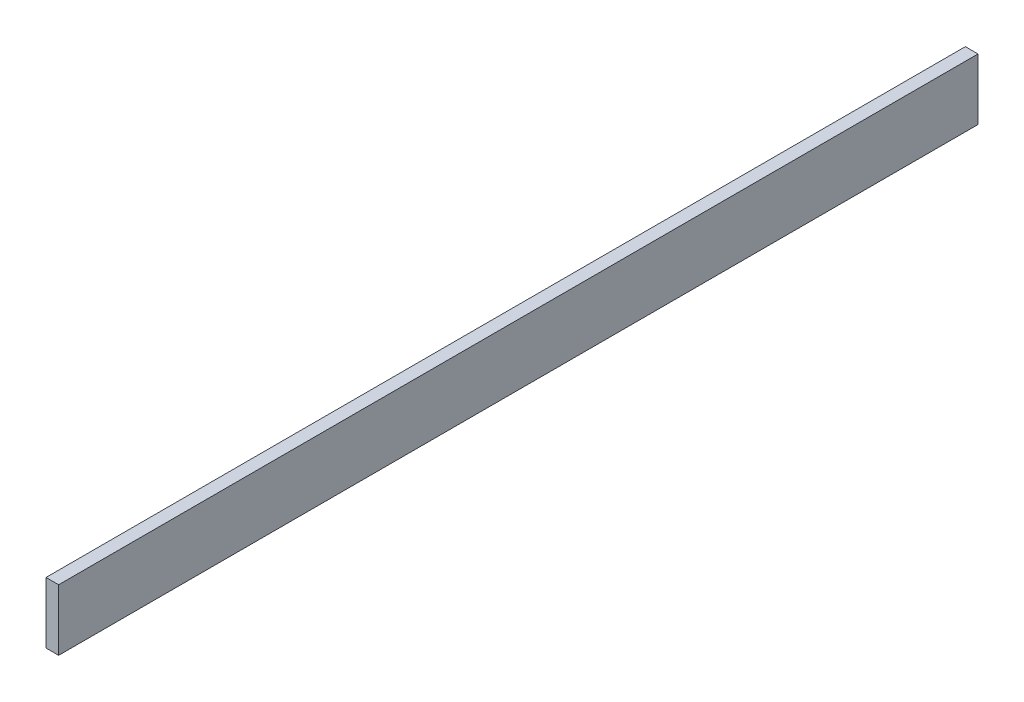
ISO-10303-21;
HEADER;
FILE_DESCRIPTION(('STEP AP214'),'2;1');
FILE_NAME('part.step','',(''),(''),'','','');
FILE_SCHEMA(('AUTOMOTIVE_DESIGN { 1 0 10303 214 1 1 1 1 }'));
ENDSEC;
DATA;
#1=APPLICATION_CONTEXT('core data for automotive mechanical design processes');
#2=APPLICATION_PROTOCOL_DEFINITION('international standard','automotive_design',2000,#1);
#3=PRODUCT_CONTEXT('',#1,'mechanical');
#4=PRODUCT('Part','Part','',(#3));
#5=PRODUCT_RELATED_PRODUCT_CATEGORY('part','',(#4));
#6=PRODUCT_DEFINITION_FORMATION('','',#4);
#7=PRODUCT_DEFINITION_CONTEXT('part definition',#1,'design');
#8=PRODUCT_DEFINITION('design','',#6,#7);
#9=PRODUCT_DEFINITION_SHAPE('','',#8);
#10=(LENGTH_UNIT() NAMED_UNIT(*) SI_UNIT(.MILLI.,.METRE.));
#11=(NAMED_UNIT(*) PLANE_ANGLE_UNIT() SI_UNIT($,.RADIAN.));
#12=(NAMED_UNIT(*) SI_UNIT($,.STERADIAN.) SOLID_ANGLE_UNIT());
#13=UNCERTAINTY_MEASURE_WITH_UNIT(LENGTH_MEASURE(1.E-05),#10,'distance_accuracy_value','');
#14=(GEOMETRIC_REPRESENTATION_CONTEXT(3) GLOBAL_UNCERTAINTY_ASSIGNED_CONTEXT((#13)) GLOBAL_UNIT_ASSIGNED_CONTEXT((#10,
#11,#12)) REPRESENTATION_CONTEXT('',''));
#15=CARTESIAN_POINT('',(0.,0.,0.));
#16=DIRECTION('',(0.,0.,1.));
#17=DIRECTION('',(1.,0.,0.));
#18=AXIS2_PLACEMENT_3D('',#15,#16,#17);
#19=CARTESIAN_POINT('',(38.1,50.8,474.171818181819));
#20=DIRECTION('',(0.,0.,-1.));
#21=DIRECTION('',(-1.,0.,0.));
#22=AXIS2_PLACEMENT_3D('',#19,#20,#21);
#23=PLANE('',#22);
#24=DIRECTION('',(0.,-1.,0.));
#25=VECTOR('',#24,1.);
#26=CARTESIAN_POINT('',(0.,50.8,474.171818181819));
#27=LINE('',#26,#25);
#28=CARTESIAN_POINT('',(0.,234.95,474.171818181819));
#29=VERTEX_POINT('',#28);
#30=CARTESIAN_POINT('',(0.,50.8,474.171818181819));
#31=VERTEX_POINT('',#30);
#32=EDGE_CURVE('E96',#29,#31,#27,.T.);
#33=ORIENTED_EDGE('',*,*,#32,.T.);
#34=DIRECTION('',(-1.,0.,0.));
#35=VECTOR('',#34,1.);
#36=CARTESIAN_POINT('',(38.1,50.8,474.171818181819));
#37=LINE('',#36,#35);
#38=CARTESIAN_POINT('',(38.1,50.8,474.171818181819));
#39=VERTEX_POINT('',#38);
#40=EDGE_CURVE('E11',#39,#31,#37,.T.);
#41=ORIENTED_EDGE('',*,*,#40,.F.);
#42=DIRECTION('',(0.,-1.,0.));
#43=VECTOR('',#42,1.);
#44=CARTESIAN_POINT('',(38.1,50.8,474.171818181819));
#45=LINE('',#44,#43);
#46=CARTESIAN_POINT('',(38.1,234.95,474.171818181819));
#47=VERTEX_POINT('',#46);
#48=EDGE_CURVE('E84',#47,#39,#45,.T.);
#49=ORIENTED_EDGE('',*,*,#48,.F.);
#50=DIRECTION('',(-1.,0.,0.));
#51=VECTOR('',#50,1.);
#52=CARTESIAN_POINT('',(38.1,234.95,474.171818181819));
#53=LINE('',#52,#51);
#54=EDGE_CURVE('E92',#47,#29,#53,.T.);
#55=ORIENTED_EDGE('',*,*,#54,.T.);
#56=EDGE_LOOP('',(#33,#41,#49,#55));
#57=FACE_BOUND('',#56,.T.);
#58=ADVANCED_FACE('F33',(#57),#23,.F.);
#59=CARTESIAN_POINT('',(38.1,50.8,474.171818181819));
#60=DIRECTION('',(0.,1.,0.));
#61=DIRECTION('',(0.,0.,1.));
#62=AXIS2_PLACEMENT_3D('',#59,#60,#61);
#63=PLANE('',#62);
#64=DIRECTION('',(0.,0.,-1.));
#65=VECTOR('',#64,1.);
#66=CARTESIAN_POINT('',(0.,50.8,474.171818181819));
#67=LINE('',#66,#65);
#68=CARTESIAN_POINT('',(0.,50.8,-2294.42818181818));
#69=VERTEX_POINT('',#68);
#70=EDGE_CURVE('E88',#31,#69,#67,.T.);
#71=ORIENTED_EDGE('',*,*,#70,.T.);
#72=DIRECTION('',(-1.,0.,0.));
#73=VECTOR('',#72,1.);
#74=CARTESIAN_POINT('',(38.1,50.8,-2294.42818181818));
#75=LINE('',#74,#73);
#76=CARTESIAN_POINT('',(38.1,50.8,-2294.42818181818));
#77=VERTEX_POINT('',#76);
#78=EDGE_CURVE('E41',#77,#69,#75,.T.);
#79=ORIENTED_EDGE('',*,*,#78,.F.);
#80=DIRECTION('',(0.,0.,-1.));
#81=VECTOR('',#80,1.);
#82=CARTESIAN_POINT('',(38.1,50.8,474.171818181819));
#83=LINE('',#82,#81);
#84=EDGE_CURVE('E79',#39,#77,#83,.T.);
#85=ORIENTED_EDGE('',*,*,#84,.F.);
#86=ORIENTED_EDGE('',*,*,#40,.T.);
#87=EDGE_LOOP('',(#71,#79,#85,#86));
#88=FACE_BOUND('',#87,.T.);
#89=ADVANCED_FACE('F87',(#88),#63,.F.);
#90=CARTESIAN_POINT('',(38.1,50.8,-2294.42818181818));
#91=DIRECTION('',(0.,0.,1.));
#92=DIRECTION('',(1.,0.,0.));
#93=AXIS2_PLACEMENT_3D('',#90,#91,#92);
#94=PLANE('',#93);
#95=DIRECTION('',(0.,1.,0.));
#96=VECTOR('',#95,1.);
#97=CARTESIAN_POINT('',(0.,50.8,-2294.42818181818));
#98=LINE('',#97,#96);
#99=CARTESIAN_POINT('',(0.,234.95,-2294.42818181818));
#100=VERTEX_POINT('',#99);
#101=EDGE_CURVE('E66',#69,#100,#98,.T.);
#102=ORIENTED_EDGE('',*,*,#101,.T.);
#103=DIRECTION('',(-1.,0.,0.));
#104=VECTOR('',#103,1.);
#105=CARTESIAN_POINT('',(38.1,234.95,-2294.42818181818));
#106=LINE('',#105,#104);
#107=CARTESIAN_POINT('',(38.1,234.95,-2294.42818181818));
#108=VERTEX_POINT('',#107);
#109=EDGE_CURVE('E89',#108,#100,#106,.T.);
#110=ORIENTED_EDGE('',*,*,#109,.F.);
#111=DIRECTION('',(0.,1.,0.));
#112=VECTOR('',#111,1.);
#113=CARTESIAN_POINT('',(38.1,50.8,-2294.42818181818));
#114=LINE('',#113,#112);
#115=EDGE_CURVE('E82',#77,#108,#114,.T.);
#116=ORIENTED_EDGE('',*,*,#115,.F.);
#117=ORIENTED_EDGE('',*,*,#78,.T.);
#118=EDGE_LOOP('',(#102,#110,#116,#117));
#119=FACE_BOUND('',#118,.T.);
#120=ADVANCED_FACE('F90',(#119),#94,.F.);
#121=CARTESIAN_POINT('',(38.1,234.95,474.171818181819));
#122=DIRECTION('',(0.,-1.,0.));
#123=DIRECTION('',(0.,0.,-1.));
#124=AXIS2_PLACEMENT_3D('',#121,#122,#123);
#125=PLANE('',#124);
#126=DIRECTION('',(0.,0.,1.));
#127=VECTOR('',#126,1.);
#128=CARTESIAN_POINT('',(0.,234.95,474.171818181819));
#129=LINE('',#128,#127);
#130=EDGE_CURVE('E72',#100,#29,#129,.T.);
#131=ORIENTED_EDGE('',*,*,#130,.T.);
#132=ORIENTED_EDGE('',*,*,#54,.F.);
#133=DIRECTION('',(0.,0.,1.));
#134=VECTOR('',#133,1.);
#135=CARTESIAN_POINT('',(38.1,234.95,474.171818181819));
#136=LINE('',#135,#134);
#137=EDGE_CURVE('E49',#108,#47,#136,.T.);
#138=ORIENTED_EDGE('',*,*,#137,.F.);
#139=ORIENTED_EDGE('',*,*,#109,.T.);
#140=EDGE_LOOP('',(#131,#132,#138,#139));
#141=FACE_BOUND('',#140,.T.);
#142=ADVANCED_FACE('F103',(#141),#125,.F.);
#143=CARTESIAN_POINT('',(38.1,0.,0.));
#144=DIRECTION('',(-1.,0.,0.));
#145=DIRECTION('',(0.,0.,1.));
#146=AXIS2_PLACEMENT_3D('',#143,#144,#145);
#147=PLANE('',#146);
#148=ORIENTED_EDGE('',*,*,#48,.T.);
#149=ORIENTED_EDGE('',*,*,#84,.T.);
#150=ORIENTED_EDGE('',*,*,#115,.T.);
#151=ORIENTED_EDGE('',*,*,#137,.T.);
#152=EDGE_LOOP('',(#148,#149,#150,#151));
#153=FACE_BOUND('',#152,.T.);
#154=ADVANCED_FACE('F80',(#153),#147,.F.);
#155=CARTESIAN_POINT('',(0.,0.,0.));
#156=DIRECTION('',(-1.,0.,0.));
#157=DIRECTION('',(0.,0.,1.));
#158=AXIS2_PLACEMENT_3D('',#155,#156,#157);
#159=PLANE('',#158);
#160=ORIENTED_EDGE('',*,*,#32,.F.);
#161=ORIENTED_EDGE('',*,*,#130,.F.);
#162=ORIENTED_EDGE('',*,*,#101,.F.);
#163=ORIENTED_EDGE('',*,*,#70,.F.);
#164=EDGE_LOOP('',(#160,#161,#162,#163));
#165=FACE_BOUND('',#164,.T.);
#166=ADVANCED_FACE('F106',(#165),#159,.T.);
#167=CLOSED_SHELL('',(#58,#89,#120,#142,#154,#166));
#168=MANIFOLD_SOLID_BREP('B2',#167);
#169=ADVANCED_BREP_SHAPE_REPRESENTATION('',(#18,#168),#14);
#170=SHAPE_DEFINITION_REPRESENTATION(#9,#169);
ENDSEC;
END-ISO-10303-21;
